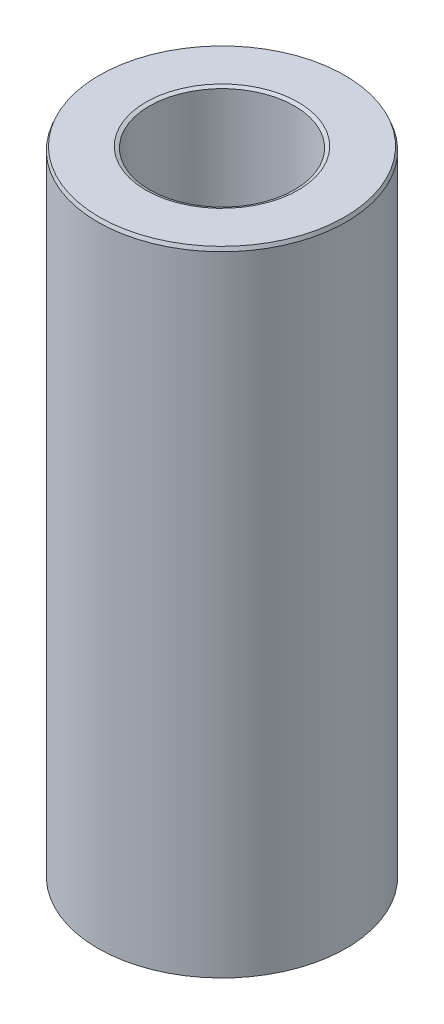
ISO-10303-21;
HEADER;
FILE_DESCRIPTION(('STEP AP214'),'2;1');
FILE_NAME('part.step','',(''),(''),'','','');
FILE_SCHEMA(('AUTOMOTIVE_DESIGN { 1 0 10303 214 1 1 1 1 }'));
ENDSEC;
DATA;
#1=APPLICATION_CONTEXT('core data for automotive mechanical design processes');
#2=APPLICATION_PROTOCOL_DEFINITION('international standard','automotive_design',2000,#1);
#3=PRODUCT_CONTEXT('',#1,'mechanical');
#4=PRODUCT('Part','Part','',(#3));
#5=PRODUCT_RELATED_PRODUCT_CATEGORY('part','',(#4));
#6=PRODUCT_DEFINITION_FORMATION('','',#4);
#7=PRODUCT_DEFINITION_CONTEXT('part definition',#1,'design');
#8=PRODUCT_DEFINITION('design','',#6,#7);
#9=PRODUCT_DEFINITION_SHAPE('','',#8);
#10=(LENGTH_UNIT() NAMED_UNIT(*) SI_UNIT(.MILLI.,.METRE.));
#11=(NAMED_UNIT(*) PLANE_ANGLE_UNIT() SI_UNIT($,.RADIAN.));
#12=(NAMED_UNIT(*) SI_UNIT($,.STERADIAN.) SOLID_ANGLE_UNIT());
#13=UNCERTAINTY_MEASURE_WITH_UNIT(LENGTH_MEASURE(1.E-05),#10,'distance_accuracy_value','');
#14=(GEOMETRIC_REPRESENTATION_CONTEXT(3) GLOBAL_UNCERTAINTY_ASSIGNED_CONTEXT((#13)) GLOBAL_UNIT_ASSIGNED_CONTEXT((#10,
#11,#12)) REPRESENTATION_CONTEXT('',''));
#15=CARTESIAN_POINT('',(0.,0.,0.));
#16=DIRECTION('',(0.,0.,1.));
#17=DIRECTION('',(1.,0.,0.));
#18=AXIS2_PLACEMENT_3D('',#15,#16,#17);
#19=CARTESIAN_POINT('',(0.,255.204608441322,0.));
#20=DIRECTION('',(0.,-1.,0.));
#21=DIRECTION('',(0.,0.,-1.));
#22=AXIS2_PLACEMENT_3D('',#19,#20,#21);
#23=CYLINDRICAL_SURFACE('',#22,50.);
#24=CARTESIAN_POINT('',(0.,0.598637210071973,0.));
#25=DIRECTION('',(0.,1.,0.));
#26=DIRECTION('',(0.,0.,1.));
#27=AXIS2_PLACEMENT_3D('',#24,#25,#26);
#28=CIRCLE('',#27,50.);
#29=CARTESIAN_POINT('',(0.,0.598637210071973,50.));
#30=VERTEX_POINT('',#29);
#31=EDGE_CURVE('E10',#30,#30,#28,.T.);
#32=ORIENTED_EDGE('',*,*,#31,.T.);
#33=EDGE_LOOP('',(#32));
#34=FACE_BOUND('',#33,.T.);
#35=CARTESIAN_POINT('',(0.,253.745260158551,0.));
#36=DIRECTION('',(0.,1.,0.));
#37=DIRECTION('',(0.,0.,1.));
#38=AXIS2_PLACEMENT_3D('',#35,#36,#37);
#39=CIRCLE('',#38,50.);
#40=CARTESIAN_POINT('',(0.,253.745260158551,50.));
#41=VERTEX_POINT('',#40);
#42=EDGE_CURVE('E50',#41,#41,#39,.F.);
#43=ORIENTED_EDGE('',*,*,#42,.T.);
#44=EDGE_LOOP('',(#43));
#45=FACE_BOUND('',#44,.T.);
#46=ADVANCED_FACE('F39',(#34,#45),#23,.T.);
#47=CARTESIAN_POINT('',(0.,255.204608441322,0.));
#48=DIRECTION('',(0.,1.,0.));
#49=DIRECTION('',(0.,0.,1.));
#50=AXIS2_PLACEMENT_3D('',#47,#48,#49);
#51=PLANE('',#50);
#52=CARTESIAN_POINT('',(0.,255.204608441322,0.));
#53=DIRECTION('',(0.,1.,0.));
#54=DIRECTION('',(0.,0.,1.));
#55=AXIS2_PLACEMENT_3D('',#52,#53,#54);
#56=CIRCLE('',#55,30.6699485780685);
#57=CARTESIAN_POINT('',(0.,255.204608441322,30.6699485780685));
#58=VERTEX_POINT('',#57);
#59=EDGE_CURVE('E58',#58,#58,#56,.F.);
#60=ORIENTED_EDGE('',*,*,#59,.T.);
#61=EDGE_LOOP('',(#60));
#62=FACE_BOUND('',#61,.T.);
#63=CARTESIAN_POINT('',(0.,255.204608441322,0.));
#64=DIRECTION('',(0.,1.,0.));
#65=DIRECTION('',(0.,0.,1.));
#66=AXIS2_PLACEMENT_3D('',#63,#64,#65);
#67=CIRCLE('',#66,49.4013627899279);
#68=CARTESIAN_POINT('',(0.,255.204608441322,49.4013627899279));
#69=VERTEX_POINT('',#68);
#70=EDGE_CURVE('E61',#69,#69,#67,.T.);
#71=ORIENTED_EDGE('',*,*,#70,.T.);
#72=EDGE_LOOP('',(#71));
#73=FACE_BOUND('',#72,.T.);
#74=ADVANCED_FACE('F88',(#62,#73),#51,.T.);
#75=CARTESIAN_POINT('',(0.,0.,0.));
#76=DIRECTION('',(0.,1.,0.));
#77=DIRECTION('',(0.,0.,1.));
#78=AXIS2_PLACEMENT_3D('',#75,#76,#77);
#79=PLANE('',#78);
#80=CARTESIAN_POINT('',(0.,0.,0.));
#81=DIRECTION('',(0.,1.,0.));
#82=DIRECTION('',(0.,0.,1.));
#83=AXIS2_PLACEMENT_3D('',#80,#81,#82);
#84=CIRCLE('',#83,29.8092375053692);
#85=CARTESIAN_POINT('',(0.,0.,-29.8092375053692));
#86=VERTEX_POINT('',#85);
#87=EDGE_CURVE('E51',#86,#86,#84,.T.);
#88=ORIENTED_EDGE('',*,*,#87,.T.);
#89=EDGE_LOOP('',(#88));
#90=FACE_BOUND('',#89,.T.);
#91=CARTESIAN_POINT('',(0.,0.,0.));
#92=DIRECTION('',(0.,1.,0.));
#93=DIRECTION('',(0.,0.,1.));
#94=AXIS2_PLACEMENT_3D('',#91,#92,#93);
#95=CIRCLE('',#94,48.5406517172287);
#96=CARTESIAN_POINT('',(0.,0.,48.5406517172287));
#97=VERTEX_POINT('',#96);
#98=EDGE_CURVE('E54',#97,#97,#95,.F.);
#99=ORIENTED_EDGE('',*,*,#98,.T.);
#100=EDGE_LOOP('',(#99));
#101=FACE_BOUND('',#100,.T.);
#102=ADVANCED_FACE('F83',(#90,#101),#79,.F.);
#103=CARTESIAN_POINT('',(0.,255.204608441322,0.));
#104=DIRECTION('',(0.,-1.,0.));
#105=DIRECTION('',(0.,0.,-1.));
#106=AXIS2_PLACEMENT_3D('',#103,#104,#105);
#107=CYLINDRICAL_SURFACE('',#106,29.2106002952972);
#108=CARTESIAN_POINT('',(0.,254.60597123125,0.));
#109=DIRECTION('',(0.,1.,0.));
#110=DIRECTION('',(0.,0.,1.));
#111=AXIS2_PLACEMENT_3D('',#108,#109,#110);
#112=CIRCLE('',#111,29.2106002952972);
#113=CARTESIAN_POINT('',(0.,254.60597123125,29.2106002952972));
#114=VERTEX_POINT('',#113);
#115=EDGE_CURVE('E67',#114,#114,#112,.T.);
#116=ORIENTED_EDGE('',*,*,#115,.T.);
#117=EDGE_LOOP('',(#116));
#118=FACE_BOUND('',#117,.T.);
#119=CARTESIAN_POINT('',(0.,1.45934828277128,0.));
#120=DIRECTION('',(0.,1.,0.));
#121=DIRECTION('',(0.,0.,1.));
#122=AXIS2_PLACEMENT_3D('',#119,#120,#121);
#123=CIRCLE('',#122,29.2106002952972);
#124=CARTESIAN_POINT('',(0.,1.45934828277128,-29.2106002952972));
#125=VERTEX_POINT('',#124);
#126=EDGE_CURVE('E69',#125,#125,#123,.F.);
#127=ORIENTED_EDGE('',*,*,#126,.T.);
#128=EDGE_LOOP('',(#127));
#129=FACE_BOUND('',#128,.T.);
#130=ADVANCED_FACE('F71',(#118,#129),#107,.F.);
#131=CARTESIAN_POINT('',(0.,254.60597123125,0.));
#132=DIRECTION('',(0.,1.,0.));
#133=DIRECTION('',(0.,0.,1.));
#134=AXIS2_PLACEMENT_3D('',#131,#132,#133);
#135=CONICAL_SURFACE('',#134,29.2106002952972,1.18152053168488);
#136=ORIENTED_EDGE('',*,*,#59,.F.);
#137=EDGE_LOOP('',(#136));
#138=FACE_BOUND('',#137,.T.);
#139=ORIENTED_EDGE('',*,*,#115,.F.);
#140=EDGE_LOOP('',(#139));
#141=FACE_BOUND('',#140,.T.);
#142=ADVANCED_FACE('F77',(#138,#141),#135,.F.);
#143=CARTESIAN_POINT('',(0.,0.,0.));
#144=DIRECTION('',(0.,-1.,0.));
#145=DIRECTION('',(0.,0.,-1.));
#146=AXIS2_PLACEMENT_3D('',#143,#144,#145);
#147=CONICAL_SURFACE('',#146,29.8092375053692,0.389275795110016);
#148=CARTESIAN_POINT('',(0.,1.45934828277128,-29.2106002952972));
#149=CARTESIAN_POINT('',(0.,1.44414673815908,-29.2168360995688));
#150=CARTESIAN_POINT('',(0.,1.42894519354688,-29.2230719038404));
#151=CARTESIAN_POINT('',(0.,1.39854210432247,-29.2355435123835));
#152=CARTESIAN_POINT('',(0.,1.38334055971027,-29.2417793166551));
#153=CARTESIAN_POINT('',(0.,1.35293747048587,-29.2542509251983));
#154=CARTESIAN_POINT('',(0.,1.33773592587367,-29.2604867294699));
#155=CARTESIAN_POINT('',(0.,1.30733283664927,-29.272958338013));
#156=CARTESIAN_POINT('',(0.,1.29213129203707,-29.2791941422846));
#157=CARTESIAN_POINT('',(0.,1.26172820281267,-29.2916657508278));
#158=CARTESIAN_POINT('',(0.,1.24652665820047,-29.2979015550994));
#159=CARTESIAN_POINT('',(0.,1.21612356897606,-29.3103731636425));
#160=CARTESIAN_POINT('',(0.,1.20092202436386,-29.3166089679141));
#161=CARTESIAN_POINT('',(0.,1.17051893513946,-29.3290805764573));
#162=CARTESIAN_POINT('',(0.,1.15531739052726,-29.3353163807289));
#163=CARTESIAN_POINT('',(0.,1.12491430130286,-29.347787989272));
#164=CARTESIAN_POINT('',(0.,1.10971275669066,-29.3540237935436));
#165=CARTESIAN_POINT('',(0.,1.07930966746626,-29.3664954020868));
#166=CARTESIAN_POINT('',(0.,1.06410812285406,-29.3727312063584));
#167=CARTESIAN_POINT('',(0.,1.03370503362966,-29.3852028149015));
#168=CARTESIAN_POINT('',(0.,1.01850348901745,-29.3914386191731));
#169=CARTESIAN_POINT('',(0.,0.988100399793053,-29.4039102277163));
#170=CARTESIAN_POINT('',(0.,0.972898855180852,-29.4101460319879));
#171=CARTESIAN_POINT('',(0.,0.94249576595645,-29.422617640531));
#172=CARTESIAN_POINT('',(0.,0.927294221344249,-29.4288534448026));
#173=CARTESIAN_POINT('',(0.,0.896891132119848,-29.4413250533458));
#174=CARTESIAN_POINT('',(0.,0.881689587507647,-29.4475608576174));
#175=CARTESIAN_POINT('',(0.,0.851286498283245,-29.4600324661605));
#176=CARTESIAN_POINT('',(0.,0.836084953671045,-29.4662682704321));
#177=CARTESIAN_POINT('',(0.,0.805681864446643,-29.4787398789753));
#178=CARTESIAN_POINT('',(0.,0.790480319834442,-29.4849756832469));
#179=CARTESIAN_POINT('',(0.,0.76007723061004,-29.49744729179));
#180=CARTESIAN_POINT('',(0.,0.744875685997839,-29.5036830960616));
#181=CARTESIAN_POINT('',(0.,0.714472596773438,-29.5161547046048));
#182=CARTESIAN_POINT('',(0.,0.699271052161237,-29.5223905088764));
#183=CARTESIAN_POINT('',(0.,0.668867962936836,-29.5348621174195));
#184=CARTESIAN_POINT('',(0.,0.653666418324635,-29.5410979216911));
#185=CARTESIAN_POINT('',(0.,0.623263329100233,-29.5535695302343));
#186=CARTESIAN_POINT('',(0.,0.608061784488032,-29.5598053345059));
#187=CARTESIAN_POINT('',(0.,0.577658695263631,-29.572276943049));
#188=CARTESIAN_POINT('',(0.,0.56245715065143,-29.5785127473206));
#189=CARTESIAN_POINT('',(0.,0.532054061427028,-29.5909843558638));
#190=CARTESIAN_POINT('',(0.,0.516852516814827,-29.5972201601354));
#191=CARTESIAN_POINT('',(0.,0.486449427590426,-29.6096917686785));
#192=CARTESIAN_POINT('',(0.,0.471247882978225,-29.6159275729501));
#193=CARTESIAN_POINT('',(0.,0.440844793753824,-29.6283991814933));
#194=CARTESIAN_POINT('',(0.,0.425643249141622,-29.6346349857649));
#195=CARTESIAN_POINT('',(0.,0.395240159917221,-29.647106594308));
#196=CARTESIAN_POINT('',(0.,0.38003861530502,-29.6533423985796));
#197=CARTESIAN_POINT('',(0.,0.349635526080619,-29.6658140071228));
#198=CARTESIAN_POINT('',(0.,0.334433981468418,-29.6720498113944));
#199=CARTESIAN_POINT('',(0.,0.304030892244016,-29.6845214199375));
#200=CARTESIAN_POINT('',(0.,0.288829347631816,-29.6907572242091));
#201=CARTESIAN_POINT('',(0.,0.258426258407414,-29.7032288327523));
#202=CARTESIAN_POINT('',(0.,0.243224713795213,-29.7094646370239));
#203=CARTESIAN_POINT('',(0.,0.212821624570811,-29.721936245567));
#204=CARTESIAN_POINT('',(0.,0.19762007995861,-29.7281720498386));
#205=CARTESIAN_POINT('',(0.,0.167216990734209,-29.7406436583818));
#206=CARTESIAN_POINT('',(0.,0.152015446122008,-29.7468794626534));
#207=CARTESIAN_POINT('',(0.,0.121612356897607,-29.7593510711965));
#208=CARTESIAN_POINT('',(0.,0.106410812285406,-29.7655868754681));
#209=CARTESIAN_POINT('',(0.,0.0760077230610042,-29.7780584840113));
#210=CARTESIAN_POINT('',(0.,0.0608061784488032,-29.7842942882829));
#211=CARTESIAN_POINT('',(0.,0.0304030892244012,-29.796765896826));
#212=CARTESIAN_POINT('',(0.,0.0152015446122002,-29.8030017010976));
#213=CARTESIAN_POINT('',(0.,0.,-29.8092375053692));
#214=B_SPLINE_CURVE_WITH_KNOTS('',3,(#148,#149,#150,#151,#152,#153,#154,#155,#156,#157,#158,
#159,#160,#161,#162,#163,#164,#165,#166,#167,#168,#169,#170,#171,#172,#173,#174,#175,#176,#177,
#178,#179,#180,#181,#182,#183,#184,#185,#186,#187,#188,#189,#190,#191,#192,#193,#194,#195,#196,
#197,#198,#199,#200,#201,#202,#203,#204,#205,#206,#207,#208,#209,#210,#211,#212,#213),
.UNSPECIFIED.,.F.,.F.,(4,2,2,2,2,2,2,2,2,2,2,2,2,2,2,2,2,2,2,2,2,2,2,2,2,2,2,2,2,2,2,2,4),(0.,
0.0492924935623274,0.0985849871246535,0.147877480686981,0.197169974249308,0.246462467811636,
0.295754961373963,0.345047454936289,0.394339948498617,0.443632442060944,0.492924935623271,
0.542217429185597,0.591509922747925,0.640802416310252,0.69009490987258,0.739387403434906,
0.788679896997233,0.837972390559561,0.887264884121887,0.936557377684214,0.985849871246542,
1.03514236480887,1.0844348583712,1.13372735193352,1.18301984549585,1.23231233905818,
1.2816048326205,1.33089732618283,1.38018981974516,1.42948231330749,1.47877480686981,
1.52806730043214,1.57735979399447),.UNSPECIFIED.);
#215=EDGE_CURVE('BSEAM73',#125,#86,#214,.T.);
#216=ORIENTED_EDGE('',*,*,#126,.F.);
#217=ORIENTED_EDGE('',*,*,#87,.F.);
#218=ORIENTED_EDGE('',*,*,#215,.T.);
#219=ORIENTED_EDGE('',*,*,#215,.F.);
#220=EDGE_LOOP('',(#216,#218,#217,#219));
#221=FACE_BOUND('',#220,.T.);
#222=ADVANCED_FACE('F73',(#221),#147,.F.);
#223=CARTESIAN_POINT('',(0.,0.598637210071973,0.));
#224=DIRECTION('',(0.,1.,0.));
#225=DIRECTION('',(0.,0.,1.));
#226=AXIS2_PLACEMENT_3D('',#223,#224,#225);
#227=CONICAL_SURFACE('',#226,50.,1.18152053168491);
#228=ORIENTED_EDGE('',*,*,#98,.F.);
#229=EDGE_LOOP('',(#228));
#230=FACE_BOUND('',#229,.T.);
#231=ORIENTED_EDGE('',*,*,#31,.F.);
#232=EDGE_LOOP('',(#231));
#233=FACE_BOUND('',#232,.T.);
#234=ADVANCED_FACE('F76',(#230,#233),#227,.T.);
#235=CARTESIAN_POINT('',(0.,255.204608441322,0.));
#236=DIRECTION('',(0.,-1.,0.));
#237=DIRECTION('',(0.,0.,-1.));
#238=AXIS2_PLACEMENT_3D('',#235,#236,#237);
#239=CONICAL_SURFACE('',#238,49.4013627899279,0.389275795110012);
#240=ORIENTED_EDGE('',*,*,#42,.F.);
#241=EDGE_LOOP('',(#240));
#242=FACE_BOUND('',#241,.T.);
#243=ORIENTED_EDGE('',*,*,#70,.F.);
#244=EDGE_LOOP('',(#243));
#245=FACE_BOUND('',#244,.T.);
#246=ADVANCED_FACE('F45',(#242,#245),#239,.T.);
#247=CLOSED_SHELL('',(#46,#74,#102,#130,#142,#222,#234,#246));
#248=MANIFOLD_SOLID_BREP('B2',#247);
#249=ADVANCED_BREP_SHAPE_REPRESENTATION('',(#18,#248),#14);
#250=SHAPE_DEFINITION_REPRESENTATION(#9,#249);
ENDSEC;
END-ISO-10303-21;
